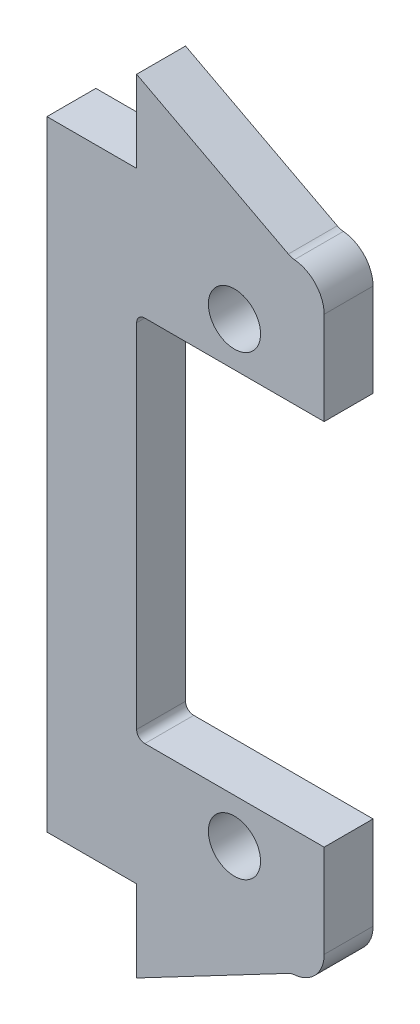
ISO-10303-21;
HEADER;
FILE_DESCRIPTION(('STEP AP214'),'2;1');
FILE_NAME('part.step','',(''),(''),'','','');
FILE_SCHEMA(('AUTOMOTIVE_DESIGN { 1 0 10303 214 1 1 1 1 }'));
ENDSEC;
DATA;
#1=APPLICATION_CONTEXT('core data for automotive mechanical design processes');
#2=APPLICATION_PROTOCOL_DEFINITION('international standard','automotive_design',2000,#1);
#3=PRODUCT_CONTEXT('',#1,'mechanical');
#4=PRODUCT('Part','Part','',(#3));
#5=PRODUCT_RELATED_PRODUCT_CATEGORY('part','',(#4));
#6=PRODUCT_DEFINITION_FORMATION('','',#4);
#7=PRODUCT_DEFINITION_CONTEXT('part definition',#1,'design');
#8=PRODUCT_DEFINITION('design','',#6,#7);
#9=PRODUCT_DEFINITION_SHAPE('','',#8);
#10=(LENGTH_UNIT() NAMED_UNIT(*) SI_UNIT(.MILLI.,.METRE.));
#11=(NAMED_UNIT(*) PLANE_ANGLE_UNIT() SI_UNIT($,.RADIAN.));
#12=(NAMED_UNIT(*) SI_UNIT($,.STERADIAN.) SOLID_ANGLE_UNIT());
#13=UNCERTAINTY_MEASURE_WITH_UNIT(LENGTH_MEASURE(1.E-05),#10,'distance_accuracy_value','');
#14=(GEOMETRIC_REPRESENTATION_CONTEXT(3) GLOBAL_UNCERTAINTY_ASSIGNED_CONTEXT((#13)) GLOBAL_UNIT_ASSIGNED_CONTEXT((#10,
#11,#12)) REPRESENTATION_CONTEXT('',''));
#15=CARTESIAN_POINT('',(0.,0.,0.));
#16=DIRECTION('',(0.,0.,1.));
#17=DIRECTION('',(1.,0.,0.));
#18=AXIS2_PLACEMENT_3D('',#15,#16,#17);
#19=CARTESIAN_POINT('',(0.,0.,3.));
#20=DIRECTION('',(0.,0.,-1.));
#21=DIRECTION('',(-1.,0.,0.));
#22=AXIS2_PLACEMENT_3D('',#19,#20,#21);
#23=PLANE('',#22);
#24=DIRECTION('',(0.,1.,0.));
#25=VECTOR('',#24,1.);
#26=CARTESIAN_POINT('',(17.,19.,3.));
#27=LINE('',#26,#25);
#28=CARTESIAN_POINT('',(17.,11.3,3.));
#29=VERTEX_POINT('',#28);
#30=CARTESIAN_POINT('',(17.,17.,3.));
#31=VERTEX_POINT('',#30);
#32=EDGE_CURVE('E265',#29,#31,#27,.T.);
#33=ORIENTED_EDGE('',*,*,#32,.T.);
#34=CARTESIAN_POINT('',(15.,17.,3.));
#35=DIRECTION('',(0.,0.,-1.));
#36=DIRECTION('',(-1.,0.,0.));
#37=AXIS2_PLACEMENT_3D('',#34,#35,#36);
#38=CIRCLE('',#37,2.);
#39=CARTESIAN_POINT('',(15.1801794962741,18.9918673020868,3.));
#40=VERTEX_POINT('',#39);
#41=EDGE_CURVE('E348',#31,#40,#38,.F.);
#42=ORIENTED_EDGE('',*,*,#41,.T.);
#43=CARTESIAN_POINT('',(15.2702692444111,19.9878009531302,3.));
#44=DIRECTION('',(0.,0.,-1.));
#45=DIRECTION('',(-1.,0.,0.));
#46=AXIS2_PLACEMENT_3D('',#43,#44,#45);
#47=CIRCLE('',#46,1.);
#48=CARTESIAN_POINT('',(14.8045228115785,19.1028827307482,3.));
#49=VERTEX_POINT('',#48);
#50=EDGE_CURVE('E11',#40,#49,#47,.T.);
#51=ORIENTED_EDGE('',*,*,#50,.T.);
#52=DIRECTION('',(-0.884918222381982,0.465746432832622,0.));
#53=VECTOR('',#52,1.);
#54=CARTESIAN_POINT('',(5.5,24.,3.));
#55=LINE('',#54,#53);
#56=CARTESIAN_POINT('',(5.5,24.,3.));
#57=VERTEX_POINT('',#56);
#58=EDGE_CURVE('E193',#49,#57,#55,.T.);
#59=ORIENTED_EDGE('',*,*,#58,.T.);
#60=DIRECTION('',(0.,-1.,0.));
#61=VECTOR('',#60,1.);
#62=CARTESIAN_POINT('',(5.5,19.,3.));
#63=LINE('',#62,#61);
#64=CARTESIAN_POINT('',(5.5,19.,3.));
#65=VERTEX_POINT('',#64);
#66=EDGE_CURVE('E204',#57,#65,#63,.T.);
#67=ORIENTED_EDGE('',*,*,#66,.T.);
#68=DIRECTION('',(-1.,0.,0.));
#69=VECTOR('',#68,1.);
#70=CARTESIAN_POINT('',(0.,19.,3.));
#71=LINE('',#70,#69);
#72=CARTESIAN_POINT('',(0.,19.,3.));
#73=VERTEX_POINT('',#72);
#74=EDGE_CURVE('E242',#65,#73,#71,.T.);
#75=ORIENTED_EDGE('',*,*,#74,.T.);
#76=DIRECTION('',(0.,-1.,0.));
#77=VECTOR('',#76,1.);
#78=CARTESIAN_POINT('',(0.,-19.,3.));
#79=LINE('',#78,#77);
#80=CARTESIAN_POINT('',(0.,-19.,3.));
#81=VERTEX_POINT('',#80);
#82=EDGE_CURVE('E245',#73,#81,#79,.T.);
#83=ORIENTED_EDGE('',*,*,#82,.T.);
#84=DIRECTION('',(1.,0.,0.));
#85=VECTOR('',#84,1.);
#86=CARTESIAN_POINT('',(17.,-19.,3.));
#87=LINE('',#86,#85);
#88=CARTESIAN_POINT('',(5.5,-19.,3.));
#89=VERTEX_POINT('',#88);
#90=EDGE_CURVE('E191',#81,#89,#87,.T.);
#91=ORIENTED_EDGE('',*,*,#90,.T.);
#92=DIRECTION('',(0.,-1.,0.));
#93=VECTOR('',#92,1.);
#94=CARTESIAN_POINT('',(5.5,-19.,3.));
#95=LINE('',#94,#93);
#96=CARTESIAN_POINT('',(5.5,-24.,3.));
#97=VERTEX_POINT('',#96);
#98=EDGE_CURVE('E175',#89,#97,#95,.T.);
#99=ORIENTED_EDGE('',*,*,#98,.T.);
#100=DIRECTION('',(0.884918222381982,0.465746432832623,0.));
#101=VECTOR('',#100,1.);
#102=CARTESIAN_POINT('',(5.5,-24.,3.));
#103=LINE('',#102,#101);
#104=CARTESIAN_POINT('',(14.8045228115785,-19.1028827307482,3.));
#105=VERTEX_POINT('',#104);
#106=EDGE_CURVE('E189',#97,#105,#103,.T.);
#107=ORIENTED_EDGE('',*,*,#106,.T.);
#108=CARTESIAN_POINT('',(15.2702692444111,-19.9878009531302,3.));
#109=DIRECTION('',(0.,0.,-1.));
#110=DIRECTION('',(-1.,0.,0.));
#111=AXIS2_PLACEMENT_3D('',#108,#109,#110);
#112=CIRCLE('',#111,1.);
#113=CARTESIAN_POINT('',(15.1801794962741,-18.9918673020868,3.));
#114=VERTEX_POINT('',#113);
#115=EDGE_CURVE('E366',#105,#114,#112,.T.);
#116=ORIENTED_EDGE('',*,*,#115,.T.);
#117=CARTESIAN_POINT('',(15.,-17.,3.));
#118=DIRECTION('',(0.,0.,-1.));
#119=DIRECTION('',(-1.,0.,0.));
#120=AXIS2_PLACEMENT_3D('',#117,#118,#119);
#121=CIRCLE('',#120,2.);
#122=CARTESIAN_POINT('',(17.,-17.,3.));
#123=VERTEX_POINT('',#122);
#124=EDGE_CURVE('E345',#114,#123,#121,.F.);
#125=ORIENTED_EDGE('',*,*,#124,.T.);
#126=DIRECTION('',(0.,1.,0.));
#127=VECTOR('',#126,1.);
#128=CARTESIAN_POINT('',(17.,-11.3,3.));
#129=LINE('',#128,#127);
#130=CARTESIAN_POINT('',(17.,-11.3,3.));
#131=VERTEX_POINT('',#130);
#132=EDGE_CURVE('E251',#123,#131,#129,.T.);
#133=ORIENTED_EDGE('',*,*,#132,.T.);
#134=DIRECTION('',(-1.,0.,0.));
#135=VECTOR('',#134,1.);
#136=CARTESIAN_POINT('',(5.5,-11.3,3.));
#137=LINE('',#136,#135);
#138=CARTESIAN_POINT('',(6.,-11.3,3.));
#139=VERTEX_POINT('',#138);
#140=EDGE_CURVE('E254',#131,#139,#137,.T.);
#141=ORIENTED_EDGE('',*,*,#140,.T.);
#142=CARTESIAN_POINT('',(6.,-10.8,3.));
#143=DIRECTION('',(0.,0.,-1.));
#144=DIRECTION('',(-1.,0.,0.));
#145=AXIS2_PLACEMENT_3D('',#142,#143,#144);
#146=CIRCLE('',#145,0.5);
#147=CARTESIAN_POINT('',(5.5,-10.8,3.));
#148=VERTEX_POINT('',#147);
#149=EDGE_CURVE('E326',#139,#148,#146,.T.);
#150=ORIENTED_EDGE('',*,*,#149,.T.);
#151=DIRECTION('',(0.,1.,0.));
#152=VECTOR('',#151,1.);
#153=CARTESIAN_POINT('',(5.5,11.3,3.));
#154=LINE('',#153,#152);
#155=CARTESIAN_POINT('',(5.5,10.8,3.));
#156=VERTEX_POINT('',#155);
#157=EDGE_CURVE('E258',#148,#156,#154,.T.);
#158=ORIENTED_EDGE('',*,*,#157,.T.);
#159=CARTESIAN_POINT('',(6.,10.8,3.));
#160=DIRECTION('',(0.,0.,-1.));
#161=DIRECTION('',(-1.,0.,0.));
#162=AXIS2_PLACEMENT_3D('',#159,#160,#161);
#163=CIRCLE('',#162,0.5);
#164=CARTESIAN_POINT('',(6.,11.3,3.));
#165=VERTEX_POINT('',#164);
#166=EDGE_CURVE('E332',#156,#165,#163,.T.);
#167=ORIENTED_EDGE('',*,*,#166,.T.);
#168=DIRECTION('',(1.,0.,0.));
#169=VECTOR('',#168,1.);
#170=CARTESIAN_POINT('',(17.,11.3,3.));
#171=LINE('',#170,#169);
#172=EDGE_CURVE('E262',#165,#29,#171,.T.);
#173=ORIENTED_EDGE('',*,*,#172,.T.);
#174=EDGE_LOOP('',(#33,#42,#51,#59,#67,#75,#83,#91,#99,#107,#116,#125,#133,#141,#150,#158,#167,#173));
#175=FACE_BOUND('',#174,.T.);
#176=CARTESIAN_POINT('',(11.5,14.,3.));
#177=DIRECTION('',(0.,0.,1.));
#178=DIRECTION('',(1.,0.,0.));
#179=AXIS2_PLACEMENT_3D('',#176,#177,#178);
#180=CIRCLE('',#179,1.6);
#181=CARTESIAN_POINT('',(13.1,14.,3.));
#182=VERTEX_POINT('',#181);
#183=EDGE_CURVE('E234',#182,#182,#180,.T.);
#184=ORIENTED_EDGE('',*,*,#183,.F.);
#185=EDGE_LOOP('',(#184));
#186=FACE_BOUND('',#185,.T.);
#187=CARTESIAN_POINT('',(11.5,-14.,3.));
#188=DIRECTION('',(0.,0.,1.));
#189=DIRECTION('',(1.,0.,0.));
#190=AXIS2_PLACEMENT_3D('',#187,#188,#189);
#191=CIRCLE('',#190,1.6);
#192=CARTESIAN_POINT('',(13.1,-14.,3.));
#193=VERTEX_POINT('',#192);
#194=EDGE_CURVE('E226',#193,#193,#191,.T.);
#195=ORIENTED_EDGE('',*,*,#194,.F.);
#196=EDGE_LOOP('',(#195));
#197=FACE_BOUND('',#196,.T.);
#198=ADVANCED_FACE('F45',(#175,#186,#197),#23,.F.);
#199=CARTESIAN_POINT('',(0.,0.,0.));
#200=DIRECTION('',(0.,0.,-1.));
#201=DIRECTION('',(-1.,0.,0.));
#202=AXIS2_PLACEMENT_3D('',#199,#200,#201);
#203=PLANE('',#202);
#204=CARTESIAN_POINT('',(11.5,14.,0.));
#205=DIRECTION('',(0.,0.,1.));
#206=DIRECTION('',(1.,0.,0.));
#207=AXIS2_PLACEMENT_3D('',#204,#205,#206);
#208=CIRCLE('',#207,1.6);
#209=CARTESIAN_POINT('',(13.1,14.,0.));
#210=VERTEX_POINT('',#209);
#211=EDGE_CURVE('E230',#210,#210,#208,.T.);
#212=ORIENTED_EDGE('',*,*,#211,.T.);
#213=EDGE_LOOP('',(#212));
#214=FACE_BOUND('',#213,.T.);
#215=DIRECTION('',(-1.,0.,0.));
#216=VECTOR('',#215,1.);
#217=CARTESIAN_POINT('',(0.,19.,0.));
#218=LINE('',#217,#216);
#219=CARTESIAN_POINT('',(5.5,19.,0.));
#220=VERTEX_POINT('',#219);
#221=CARTESIAN_POINT('',(0.,19.,0.));
#222=VERTEX_POINT('',#221);
#223=EDGE_CURVE('E238',#220,#222,#218,.T.);
#224=ORIENTED_EDGE('',*,*,#223,.F.);
#225=DIRECTION('',(0.,-1.,0.));
#226=VECTOR('',#225,1.);
#227=CARTESIAN_POINT('',(5.5,19.,0.));
#228=LINE('',#227,#226);
#229=CARTESIAN_POINT('',(5.5,24.,0.));
#230=VERTEX_POINT('',#229);
#231=EDGE_CURVE('E214',#230,#220,#228,.T.);
#232=ORIENTED_EDGE('',*,*,#231,.F.);
#233=DIRECTION('',(-0.884918222381982,0.465746432832622,0.));
#234=VECTOR('',#233,1.);
#235=CARTESIAN_POINT('',(5.5,24.,0.));
#236=LINE('',#235,#234);
#237=CARTESIAN_POINT('',(14.8045228115785,19.1028827307482,0.));
#238=VERTEX_POINT('',#237);
#239=EDGE_CURVE('E208',#238,#230,#236,.T.);
#240=ORIENTED_EDGE('',*,*,#239,.F.);
#241=CARTESIAN_POINT('',(15.2702692444111,19.9878009531302,0.));
#242=DIRECTION('',(0.,0.,-1.));
#243=DIRECTION('',(-1.,0.,0.));
#244=AXIS2_PLACEMENT_3D('',#241,#242,#243);
#245=CIRCLE('',#244,1.);
#246=CARTESIAN_POINT('',(15.1801794962741,18.9918673020868,0.));
#247=VERTEX_POINT('',#246);
#248=EDGE_CURVE('E54',#238,#247,#245,.F.);
#249=ORIENTED_EDGE('',*,*,#248,.T.);
#250=CARTESIAN_POINT('',(15.,17.,0.));
#251=DIRECTION('',(0.,0.,-1.));
#252=DIRECTION('',(-1.,0.,0.));
#253=AXIS2_PLACEMENT_3D('',#250,#251,#252);
#254=CIRCLE('',#253,2.);
#255=CARTESIAN_POINT('',(17.,17.,0.));
#256=VERTEX_POINT('',#255);
#257=EDGE_CURVE('E339',#247,#256,#254,.T.);
#258=ORIENTED_EDGE('',*,*,#257,.T.);
#259=DIRECTION('',(0.,1.,0.));
#260=VECTOR('',#259,1.);
#261=CARTESIAN_POINT('',(17.,19.,0.));
#262=LINE('',#261,#260);
#263=CARTESIAN_POINT('',(17.,11.3,0.));
#264=VERTEX_POINT('',#263);
#265=EDGE_CURVE('E246',#264,#256,#262,.T.);
#266=ORIENTED_EDGE('',*,*,#265,.F.);
#267=DIRECTION('',(1.,0.,0.));
#268=VECTOR('',#267,1.);
#269=CARTESIAN_POINT('',(17.,11.3,0.));
#270=LINE('',#269,#268);
#271=CARTESIAN_POINT('',(6.,11.3,0.));
#272=VERTEX_POINT('',#271);
#273=EDGE_CURVE('E288',#272,#264,#270,.T.);
#274=ORIENTED_EDGE('',*,*,#273,.F.);
#275=CARTESIAN_POINT('',(6.,10.8,0.));
#276=DIRECTION('',(0.,0.,-1.));
#277=DIRECTION('',(-1.,0.,0.));
#278=AXIS2_PLACEMENT_3D('',#275,#276,#277);
#279=CIRCLE('',#278,0.5);
#280=CARTESIAN_POINT('',(5.5,10.8,0.));
#281=VERTEX_POINT('',#280);
#282=EDGE_CURVE('E329',#272,#281,#279,.F.);
#283=ORIENTED_EDGE('',*,*,#282,.T.);
#284=DIRECTION('',(0.,1.,0.));
#285=VECTOR('',#284,1.);
#286=CARTESIAN_POINT('',(5.5,11.3,0.));
#287=LINE('',#286,#285);
#288=CARTESIAN_POINT('',(5.5,-10.8,0.));
#289=VERTEX_POINT('',#288);
#290=EDGE_CURVE('E284',#289,#281,#287,.T.);
#291=ORIENTED_EDGE('',*,*,#290,.F.);
#292=CARTESIAN_POINT('',(6.,-10.8,0.));
#293=DIRECTION('',(0.,0.,-1.));
#294=DIRECTION('',(-1.,0.,0.));
#295=AXIS2_PLACEMENT_3D('',#292,#293,#294);
#296=CIRCLE('',#295,0.5);
#297=CARTESIAN_POINT('',(6.,-11.3,0.));
#298=VERTEX_POINT('',#297);
#299=EDGE_CURVE('E323',#289,#298,#296,.F.);
#300=ORIENTED_EDGE('',*,*,#299,.T.);
#301=DIRECTION('',(-1.,0.,0.));
#302=VECTOR('',#301,1.);
#303=CARTESIAN_POINT('',(5.5,-11.3,0.));
#304=LINE('',#303,#302);
#305=CARTESIAN_POINT('',(17.,-11.3,0.));
#306=VERTEX_POINT('',#305);
#307=EDGE_CURVE('E280',#306,#298,#304,.T.);
#308=ORIENTED_EDGE('',*,*,#307,.F.);
#309=DIRECTION('',(0.,1.,0.));
#310=VECTOR('',#309,1.);
#311=CARTESIAN_POINT('',(17.,-11.3,0.));
#312=LINE('',#311,#310);
#313=CARTESIAN_POINT('',(17.,-17.,0.));
#314=VERTEX_POINT('',#313);
#315=EDGE_CURVE('E277',#314,#306,#312,.T.);
#316=ORIENTED_EDGE('',*,*,#315,.F.);
#317=CARTESIAN_POINT('',(15.,-17.,0.));
#318=DIRECTION('',(0.,0.,-1.));
#319=DIRECTION('',(-1.,0.,0.));
#320=AXIS2_PLACEMENT_3D('',#317,#318,#319);
#321=CIRCLE('',#320,2.);
#322=CARTESIAN_POINT('',(15.1801794962741,-18.9918673020868,0.));
#323=VERTEX_POINT('',#322);
#324=EDGE_CURVE('E335',#314,#323,#321,.T.);
#325=ORIENTED_EDGE('',*,*,#324,.T.);
#326=CARTESIAN_POINT('',(15.2702692444111,-19.9878009531302,0.));
#327=DIRECTION('',(0.,0.,-1.));
#328=DIRECTION('',(-1.,0.,0.));
#329=AXIS2_PLACEMENT_3D('',#326,#327,#328);
#330=CIRCLE('',#329,1.);
#331=CARTESIAN_POINT('',(14.8045228115785,-19.1028827307482,0.));
#332=VERTEX_POINT('',#331);
#333=EDGE_CURVE('E369',#323,#332,#330,.F.);
#334=ORIENTED_EDGE('',*,*,#333,.T.);
#335=DIRECTION('',(0.884918222381982,0.465746432832623,0.));
#336=VECTOR('',#335,1.);
#337=CARTESIAN_POINT('',(5.5,-24.,0.));
#338=LINE('',#337,#336);
#339=CARTESIAN_POINT('',(5.5,-24.,0.));
#340=VERTEX_POINT('',#339);
#341=EDGE_CURVE('E182',#340,#332,#338,.T.);
#342=ORIENTED_EDGE('',*,*,#341,.F.);
#343=DIRECTION('',(0.,-1.,0.));
#344=VECTOR('',#343,1.);
#345=CARTESIAN_POINT('',(5.5,-19.,0.));
#346=LINE('',#345,#344);
#347=CARTESIAN_POINT('',(5.5,-19.,0.));
#348=VERTEX_POINT('',#347);
#349=EDGE_CURVE('E177',#348,#340,#346,.T.);
#350=ORIENTED_EDGE('',*,*,#349,.F.);
#351=DIRECTION('',(1.,0.,0.));
#352=VECTOR('',#351,1.);
#353=CARTESIAN_POINT('',(17.,-19.,0.));
#354=LINE('',#353,#352);
#355=CARTESIAN_POINT('',(0.,-19.,0.));
#356=VERTEX_POINT('',#355);
#357=EDGE_CURVE('E274',#356,#348,#354,.T.);
#358=ORIENTED_EDGE('',*,*,#357,.F.);
#359=DIRECTION('',(0.,-1.,0.));
#360=VECTOR('',#359,1.);
#361=CARTESIAN_POINT('',(0.,-19.,0.));
#362=LINE('',#361,#360);
#363=EDGE_CURVE('E271',#222,#356,#362,.T.);
#364=ORIENTED_EDGE('',*,*,#363,.F.);
#365=EDGE_LOOP('',(#224,#232,#240,#249,#258,#266,#274,#283,#291,#300,#308,#316,#325,#334,#342,
#350,#358,#364));
#366=FACE_BOUND('',#365,.T.);
#367=CARTESIAN_POINT('',(11.5,-14.,0.));
#368=DIRECTION('',(0.,0.,1.));
#369=DIRECTION('',(1.,0.,0.));
#370=AXIS2_PLACEMENT_3D('',#367,#368,#369);
#371=CIRCLE('',#370,1.6);
#372=CARTESIAN_POINT('',(13.1,-14.,0.));
#373=VERTEX_POINT('',#372);
#374=EDGE_CURVE('E222',#373,#373,#371,.T.);
#375=ORIENTED_EDGE('',*,*,#374,.T.);
#376=EDGE_LOOP('',(#375));
#377=FACE_BOUND('',#376,.T.);
#378=ADVANCED_FACE('F374',(#214,#366,#377),#203,.T.);
#379=CARTESIAN_POINT('',(0.,19.,3.));
#380=DIRECTION('',(0.,-1.,0.));
#381=DIRECTION('',(1.,0.,0.));
#382=AXIS2_PLACEMENT_3D('',#379,#380,#381);
#383=PLANE('',#382);
#384=ORIENTED_EDGE('',*,*,#74,.F.);
#385=DIRECTION('',(0.,0.,1.));
#386=VECTOR('',#385,1.);
#387=CARTESIAN_POINT('',(5.5,19.,-10.735455276792));
#388=LINE('',#387,#386);
#389=EDGE_CURVE('E218',#220,#65,#388,.T.);
#390=ORIENTED_EDGE('',*,*,#389,.F.);
#391=ORIENTED_EDGE('',*,*,#223,.T.);
#392=DIRECTION('',(0.,0.,-1.));
#393=VECTOR('',#392,1.);
#394=CARTESIAN_POINT('',(0.,19.,3.));
#395=LINE('',#394,#393);
#396=EDGE_CURVE('E305',#73,#222,#395,.T.);
#397=ORIENTED_EDGE('',*,*,#396,.F.);
#398=EDGE_LOOP('',(#384,#390,#391,#397));
#399=FACE_BOUND('',#398,.T.);
#400=ADVANCED_FACE('F437',(#399),#383,.F.);
#401=CARTESIAN_POINT('',(0.,-19.,3.));
#402=DIRECTION('',(1.,0.,0.));
#403=DIRECTION('',(0.,0.,-1.));
#404=AXIS2_PLACEMENT_3D('',#401,#402,#403);
#405=PLANE('',#404);
#406=ORIENTED_EDGE('',*,*,#363,.T.);
#407=DIRECTION('',(0.,0.,-1.));
#408=VECTOR('',#407,1.);
#409=CARTESIAN_POINT('',(0.,-19.,3.));
#410=LINE('',#409,#408);
#411=EDGE_CURVE('E301',#81,#356,#410,.T.);
#412=ORIENTED_EDGE('',*,*,#411,.F.);
#413=ORIENTED_EDGE('',*,*,#82,.F.);
#414=ORIENTED_EDGE('',*,*,#396,.T.);
#415=EDGE_LOOP('',(#406,#412,#413,#414));
#416=FACE_BOUND('',#415,.T.);
#417=ADVANCED_FACE('F436',(#416),#405,.F.);
#418=CARTESIAN_POINT('',(17.,-19.,3.));
#419=DIRECTION('',(0.,1.,0.));
#420=DIRECTION('',(-1.,0.,0.));
#421=AXIS2_PLACEMENT_3D('',#418,#419,#420);
#422=PLANE('',#421);
#423=ORIENTED_EDGE('',*,*,#357,.T.);
#424=DIRECTION('',(0.,0.,1.));
#425=VECTOR('',#424,1.);
#426=CARTESIAN_POINT('',(5.5,-19.,-10.735455276792));
#427=LINE('',#426,#425);
#428=EDGE_CURVE('E380',#348,#89,#427,.T.);
#429=ORIENTED_EDGE('',*,*,#428,.T.);
#430=ORIENTED_EDGE('',*,*,#90,.F.);
#431=ORIENTED_EDGE('',*,*,#411,.T.);
#432=EDGE_LOOP('',(#423,#429,#430,#431));
#433=FACE_BOUND('',#432,.T.);
#434=ADVANCED_FACE('F441',(#433),#422,.F.);
#435=CARTESIAN_POINT('',(17.,-11.3,3.));
#436=DIRECTION('',(-1.,0.,0.));
#437=DIRECTION('',(0.,0.,1.));
#438=AXIS2_PLACEMENT_3D('',#435,#436,#437);
#439=PLANE('',#438);
#440=ORIENTED_EDGE('',*,*,#132,.F.);
#441=DIRECTION('',(0.,0.,-1.));
#442=VECTOR('',#441,1.);
#443=CARTESIAN_POINT('',(17.,-17.,3.));
#444=LINE('',#443,#442);
#445=EDGE_CURVE('E351',#123,#314,#444,.T.);
#446=ORIENTED_EDGE('',*,*,#445,.T.);
#447=ORIENTED_EDGE('',*,*,#315,.T.);
#448=DIRECTION('',(0.,0.,-1.));
#449=VECTOR('',#448,1.);
#450=CARTESIAN_POINT('',(17.,-11.3,3.));
#451=LINE('',#450,#449);
#452=EDGE_CURVE('E297',#131,#306,#451,.T.);
#453=ORIENTED_EDGE('',*,*,#452,.F.);
#454=EDGE_LOOP('',(#440,#446,#447,#453));
#455=FACE_BOUND('',#454,.T.);
#456=ADVANCED_FACE('F389',(#455),#439,.F.);
#457=CARTESIAN_POINT('',(5.5,-11.3,3.));
#458=DIRECTION('',(0.,-1.,0.));
#459=DIRECTION('',(0.,0.,-1.));
#460=AXIS2_PLACEMENT_3D('',#457,#458,#459);
#461=PLANE('',#460);
#462=ORIENTED_EDGE('',*,*,#307,.T.);
#463=DIRECTION('',(0.,0.,-1.));
#464=VECTOR('',#463,1.);
#465=CARTESIAN_POINT('',(6.,-11.3,3.));
#466=LINE('',#465,#464);
#467=EDGE_CURVE('E316',#298,#139,#466,.F.);
#468=ORIENTED_EDGE('',*,*,#467,.T.);
#469=ORIENTED_EDGE('',*,*,#140,.F.);
#470=ORIENTED_EDGE('',*,*,#452,.T.);
#471=EDGE_LOOP('',(#462,#468,#469,#470));
#472=FACE_BOUND('',#471,.T.);
#473=ADVANCED_FACE('F395',(#472),#461,.F.);
#474=CARTESIAN_POINT('',(5.5,11.3,3.));
#475=DIRECTION('',(-1.,0.,0.));
#476=DIRECTION('',(0.,-1.,0.));
#477=AXIS2_PLACEMENT_3D('',#474,#475,#476);
#478=PLANE('',#477);
#479=ORIENTED_EDGE('',*,*,#157,.F.);
#480=DIRECTION('',(0.,0.,-1.));
#481=VECTOR('',#480,1.);
#482=CARTESIAN_POINT('',(5.5,-10.8,0.));
#483=LINE('',#482,#481);
#484=EDGE_CURVE('E312',#148,#289,#483,.T.);
#485=ORIENTED_EDGE('',*,*,#484,.T.);
#486=ORIENTED_EDGE('',*,*,#290,.T.);
#487=DIRECTION('',(0.,0.,-1.));
#488=VECTOR('',#487,1.);
#489=CARTESIAN_POINT('',(5.5,10.8,3.));
#490=LINE('',#489,#488);
#491=EDGE_CURVE('E309',#281,#156,#490,.F.);
#492=ORIENTED_EDGE('',*,*,#491,.T.);
#493=EDGE_LOOP('',(#479,#485,#486,#492));
#494=FACE_BOUND('',#493,.T.);
#495=ADVANCED_FACE('F404',(#494),#478,.F.);
#496=CARTESIAN_POINT('',(17.,11.3,3.));
#497=DIRECTION('',(0.,1.,0.));
#498=DIRECTION('',(-1.,0.,0.));
#499=AXIS2_PLACEMENT_3D('',#496,#497,#498);
#500=PLANE('',#499);
#501=ORIENTED_EDGE('',*,*,#172,.F.);
#502=DIRECTION('',(0.,0.,-1.));
#503=VECTOR('',#502,1.);
#504=CARTESIAN_POINT('',(6.,11.3,0.));
#505=LINE('',#504,#503);
#506=EDGE_CURVE('E319',#165,#272,#505,.T.);
#507=ORIENTED_EDGE('',*,*,#506,.T.);
#508=ORIENTED_EDGE('',*,*,#273,.T.);
#509=DIRECTION('',(0.,0.,-1.));
#510=VECTOR('',#509,1.);
#511=CARTESIAN_POINT('',(17.,11.3,3.));
#512=LINE('',#511,#510);
#513=EDGE_CURVE('E268',#29,#264,#512,.T.);
#514=ORIENTED_EDGE('',*,*,#513,.F.);
#515=EDGE_LOOP('',(#501,#507,#508,#514));
#516=FACE_BOUND('',#515,.T.);
#517=ADVANCED_FACE('F412',(#516),#500,.F.);
#518=CARTESIAN_POINT('',(17.,19.,3.));
#519=DIRECTION('',(-1.,0.,0.));
#520=DIRECTION('',(0.,-1.,0.));
#521=AXIS2_PLACEMENT_3D('',#518,#519,#520);
#522=PLANE('',#521);
#523=ORIENTED_EDGE('',*,*,#265,.T.);
#524=DIRECTION('',(0.,0.,-1.));
#525=VECTOR('',#524,1.);
#526=CARTESIAN_POINT('',(17.,17.,3.));
#527=LINE('',#526,#525);
#528=EDGE_CURVE('E342',#256,#31,#527,.F.);
#529=ORIENTED_EDGE('',*,*,#528,.T.);
#530=ORIENTED_EDGE('',*,*,#32,.F.);
#531=ORIENTED_EDGE('',*,*,#513,.T.);
#532=EDGE_LOOP('',(#523,#529,#530,#531));
#533=FACE_BOUND('',#532,.T.);
#534=ADVANCED_FACE('F417',(#533),#522,.F.);
#535=CARTESIAN_POINT('',(11.5,14.,3.));
#536=DIRECTION('',(0.,0.,-1.));
#537=DIRECTION('',(-1.,0.,0.));
#538=AXIS2_PLACEMENT_3D('',#535,#536,#537);
#539=CYLINDRICAL_SURFACE('',#538,1.6);
#540=ORIENTED_EDGE('',*,*,#183,.T.);
#541=EDGE_LOOP('',(#540));
#542=FACE_BOUND('',#541,.T.);
#543=ORIENTED_EDGE('',*,*,#211,.F.);
#544=EDGE_LOOP('',(#543));
#545=FACE_BOUND('',#544,.T.);
#546=ADVANCED_FACE('F460',(#542,#545),#539,.F.);
#547=CARTESIAN_POINT('',(11.5,-14.,3.));
#548=DIRECTION('',(0.,0.,-1.));
#549=DIRECTION('',(-1.,0.,0.));
#550=AXIS2_PLACEMENT_3D('',#547,#548,#549);
#551=CYLINDRICAL_SURFACE('',#550,1.6);
#552=ORIENTED_EDGE('',*,*,#194,.T.);
#553=EDGE_LOOP('',(#552));
#554=FACE_BOUND('',#553,.T.);
#555=ORIENTED_EDGE('',*,*,#374,.F.);
#556=EDGE_LOOP('',(#555));
#557=FACE_BOUND('',#556,.T.);
#558=ADVANCED_FACE('F492',(#554,#557),#551,.F.);
#559=CARTESIAN_POINT('',(6.,-10.8,3.));
#560=DIRECTION('',(0.,0.,1.));
#561=DIRECTION('',(1.,0.,0.));
#562=AXIS2_PLACEMENT_3D('',#559,#560,#561);
#563=CYLINDRICAL_SURFACE('',#562,0.5);
#564=ORIENTED_EDGE('',*,*,#149,.F.);
#565=ORIENTED_EDGE('',*,*,#467,.F.);
#566=ORIENTED_EDGE('',*,*,#299,.F.);
#567=ORIENTED_EDGE('',*,*,#484,.F.);
#568=EDGE_LOOP('',(#564,#565,#566,#567));
#569=FACE_BOUND('',#568,.T.);
#570=ADVANCED_FACE('F399',(#569),#563,.F.);
#571=CARTESIAN_POINT('',(6.,10.8,3.));
#572=DIRECTION('',(0.,0.,1.));
#573=DIRECTION('',(1.,0.,0.));
#574=AXIS2_PLACEMENT_3D('',#571,#572,#573);
#575=CYLINDRICAL_SURFACE('',#574,0.5);
#576=ORIENTED_EDGE('',*,*,#166,.F.);
#577=ORIENTED_EDGE('',*,*,#491,.F.);
#578=ORIENTED_EDGE('',*,*,#282,.F.);
#579=ORIENTED_EDGE('',*,*,#506,.F.);
#580=EDGE_LOOP('',(#576,#577,#578,#579));
#581=FACE_BOUND('',#580,.T.);
#582=ADVANCED_FACE('F407',(#581),#575,.F.);
#583=CARTESIAN_POINT('',(15.,17.,3.));
#584=DIRECTION('',(0.,0.,-1.));
#585=DIRECTION('',(-1.,0.,0.));
#586=AXIS2_PLACEMENT_3D('',#583,#584,#585);
#587=CYLINDRICAL_SURFACE('',#586,2.);
#588=ORIENTED_EDGE('',*,*,#257,.F.);
#589=DIRECTION('',(0.,0.,-1.));
#590=VECTOR('',#589,1.);
#591=CARTESIAN_POINT('',(15.1801794962741,18.9918673020868,3.));
#592=LINE('',#591,#590);
#593=EDGE_CURVE('E67',#247,#40,#592,.F.);
#594=ORIENTED_EDGE('',*,*,#593,.T.);
#595=ORIENTED_EDGE('',*,*,#41,.F.);
#596=ORIENTED_EDGE('',*,*,#528,.F.);
#597=EDGE_LOOP('',(#588,#594,#595,#596));
#598=FACE_BOUND('',#597,.T.);
#599=ADVANCED_FACE('F420',(#598),#587,.T.);
#600=CARTESIAN_POINT('',(15.,-17.,3.));
#601=DIRECTION('',(0.,0.,-1.));
#602=DIRECTION('',(-1.,0.,0.));
#603=AXIS2_PLACEMENT_3D('',#600,#601,#602);
#604=CYLINDRICAL_SURFACE('',#603,2.);
#605=ORIENTED_EDGE('',*,*,#124,.F.);
#606=DIRECTION('',(0.,0.,-1.));
#607=VECTOR('',#606,1.);
#608=CARTESIAN_POINT('',(15.1801794962741,-18.9918673020868,3.));
#609=LINE('',#608,#607);
#610=EDGE_CURVE('E357',#114,#323,#609,.T.);
#611=ORIENTED_EDGE('',*,*,#610,.T.);
#612=ORIENTED_EDGE('',*,*,#324,.F.);
#613=ORIENTED_EDGE('',*,*,#445,.F.);
#614=EDGE_LOOP('',(#605,#611,#612,#613));
#615=FACE_BOUND('',#614,.T.);
#616=ADVANCED_FACE('F387',(#615),#604,.T.);
#617=CARTESIAN_POINT('',(5.5,24.,-10.735455276792));
#618=DIRECTION('',(0.465746432832622,0.884918222381982,0.));
#619=DIRECTION('',(-0.884918222381982,0.465746432832622,0.));
#620=AXIS2_PLACEMENT_3D('',#617,#618,#619);
#621=PLANE('',#620);
#622=ORIENTED_EDGE('',*,*,#58,.F.);
#623=DIRECTION('',(0.,0.,1.));
#624=VECTOR('',#623,1.);
#625=CARTESIAN_POINT('',(14.8045228115785,19.1028827307482,0.));
#626=LINE('',#625,#624);
#627=EDGE_CURVE('E360',#49,#238,#626,.F.);
#628=ORIENTED_EDGE('',*,*,#627,.T.);
#629=ORIENTED_EDGE('',*,*,#239,.T.);
#630=DIRECTION('',(0.,0.,1.));
#631=VECTOR('',#630,1.);
#632=CARTESIAN_POINT('',(5.5,24.,-10.735455276792));
#633=LINE('',#632,#631);
#634=EDGE_CURVE('E213',#230,#57,#633,.T.);
#635=ORIENTED_EDGE('',*,*,#634,.T.);
#636=EDGE_LOOP('',(#622,#628,#629,#635));
#637=FACE_BOUND('',#636,.T.);
#638=ADVANCED_FACE('F425',(#637),#621,.T.);
#639=CARTESIAN_POINT('',(5.5,19.,-10.735455276792));
#640=DIRECTION('',(-1.,0.,0.));
#641=DIRECTION('',(0.,-1.,0.));
#642=AXIS2_PLACEMENT_3D('',#639,#640,#641);
#643=PLANE('',#642);
#644=ORIENTED_EDGE('',*,*,#634,.F.);
#645=ORIENTED_EDGE('',*,*,#231,.T.);
#646=ORIENTED_EDGE('',*,*,#389,.T.);
#647=ORIENTED_EDGE('',*,*,#66,.F.);
#648=EDGE_LOOP('',(#644,#645,#646,#647));
#649=FACE_BOUND('',#648,.T.);
#650=ADVANCED_FACE('F430',(#649),#643,.T.);
#651=CARTESIAN_POINT('',(5.5,-19.,-10.735455276792));
#652=DIRECTION('',(-1.,0.,0.));
#653=DIRECTION('',(0.,-1.,0.));
#654=AXIS2_PLACEMENT_3D('',#651,#652,#653);
#655=PLANE('',#654);
#656=ORIENTED_EDGE('',*,*,#428,.F.);
#657=ORIENTED_EDGE('',*,*,#349,.T.);
#658=DIRECTION('',(0.,0.,1.));
#659=VECTOR('',#658,1.);
#660=CARTESIAN_POINT('',(5.5,-24.,-10.735455276792));
#661=LINE('',#660,#659);
#662=EDGE_CURVE('E171',#340,#97,#661,.T.);
#663=ORIENTED_EDGE('',*,*,#662,.T.);
#664=ORIENTED_EDGE('',*,*,#98,.F.);
#665=EDGE_LOOP('',(#656,#657,#663,#664));
#666=FACE_BOUND('',#665,.T.);
#667=ADVANCED_FACE('F174',(#666),#655,.T.);
#668=CARTESIAN_POINT('',(5.5,-24.,-10.735455276792));
#669=DIRECTION('',(0.465746432832623,-0.884918222381982,0.));
#670=DIRECTION('',(0.884918222381982,0.465746432832623,0.));
#671=AXIS2_PLACEMENT_3D('',#668,#669,#670);
#672=PLANE('',#671);
#673=ORIENTED_EDGE('',*,*,#341,.T.);
#674=DIRECTION('',(0.,0.,1.));
#675=VECTOR('',#674,1.);
#676=CARTESIAN_POINT('',(14.8045228115785,-19.1028827307482,3.));
#677=LINE('',#676,#675);
#678=EDGE_CURVE('E198',#332,#105,#677,.T.);
#679=ORIENTED_EDGE('',*,*,#678,.T.);
#680=ORIENTED_EDGE('',*,*,#106,.F.);
#681=ORIENTED_EDGE('',*,*,#662,.F.);
#682=EDGE_LOOP('',(#673,#679,#680,#681));
#683=FACE_BOUND('',#682,.T.);
#684=ADVANCED_FACE('F196',(#683),#672,.T.);
#685=CARTESIAN_POINT('',(15.2702692444111,-19.9878009531302,3.));
#686=DIRECTION('',(0.,0.,-1.));
#687=DIRECTION('',(-1.,0.,0.));
#688=AXIS2_PLACEMENT_3D('',#685,#686,#687);
#689=CYLINDRICAL_SURFACE('',#688,1.);
#690=ORIENTED_EDGE('',*,*,#333,.F.);
#691=ORIENTED_EDGE('',*,*,#610,.F.);
#692=ORIENTED_EDGE('',*,*,#115,.F.);
#693=ORIENTED_EDGE('',*,*,#678,.F.);
#694=EDGE_LOOP('',(#690,#691,#692,#693));
#695=FACE_BOUND('',#694,.T.);
#696=ADVANCED_FACE('F382',(#695),#689,.F.);
#697=CARTESIAN_POINT('',(15.2702692444111,19.9878009531302,3.));
#698=DIRECTION('',(0.,0.,-1.));
#699=DIRECTION('',(-1.,0.,0.));
#700=AXIS2_PLACEMENT_3D('',#697,#698,#699);
#701=CYLINDRICAL_SURFACE('',#700,1.);
#702=ORIENTED_EDGE('',*,*,#50,.F.);
#703=ORIENTED_EDGE('',*,*,#593,.F.);
#704=ORIENTED_EDGE('',*,*,#248,.F.);
#705=ORIENTED_EDGE('',*,*,#627,.F.);
#706=EDGE_LOOP('',(#702,#703,#704,#705));
#707=FACE_BOUND('',#706,.T.);
#708=ADVANCED_FACE('F47',(#707),#701,.F.);
#709=CLOSED_SHELL('',(#198,#378,#400,#417,#434,#456,#473,#495,#517,#534,#546,#558,#570,#582,
#599,#616,#638,#650,#667,#684,#696,#708));
#710=MANIFOLD_SOLID_BREP('B2',#709);
#711=ADVANCED_BREP_SHAPE_REPRESENTATION('',(#18,#710),#14);
#712=SHAPE_DEFINITION_REPRESENTATION(#9,#711);
ENDSEC;
END-ISO-10303-21;
